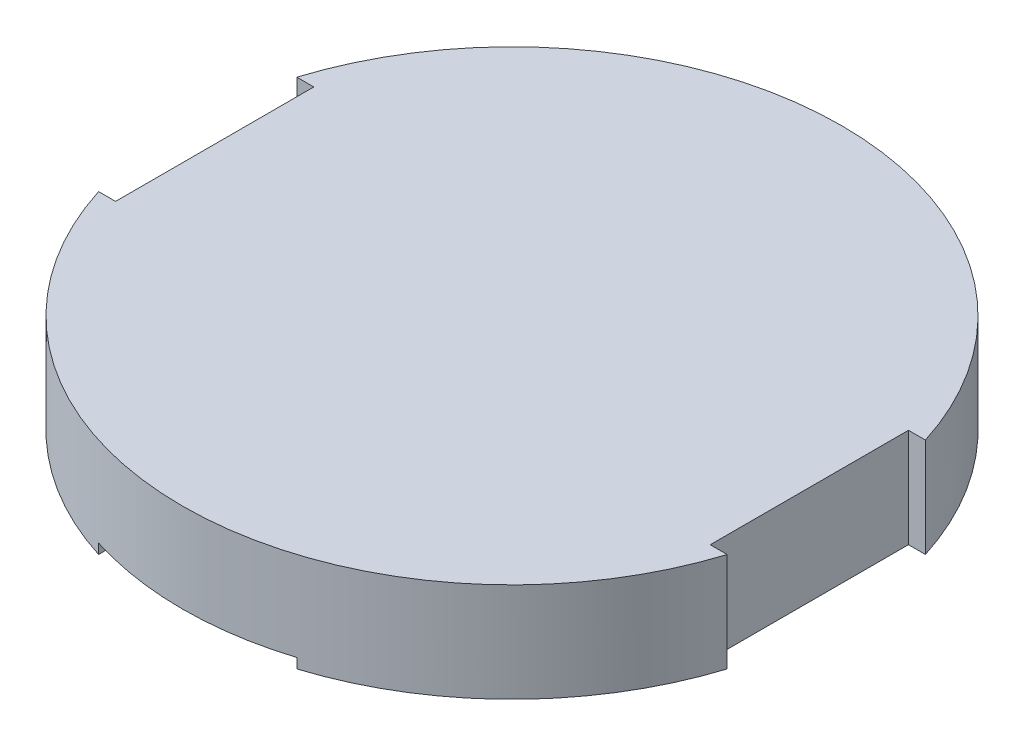
ISO-10303-21;
HEADER;
FILE_DESCRIPTION(('STEP AP214'),'2;1');
FILE_NAME('part.step','',(''),(''),'','','');
FILE_SCHEMA(('AUTOMOTIVE_DESIGN { 1 0 10303 214 1 1 1 1 }'));
ENDSEC;
DATA;
#1=APPLICATION_CONTEXT('core data for automotive mechanical design processes');
#2=APPLICATION_PROTOCOL_DEFINITION('international standard','automotive_design',2000,#1);
#3=PRODUCT_CONTEXT('',#1,'mechanical');
#4=PRODUCT('Part','Part','',(#3));
#5=PRODUCT_RELATED_PRODUCT_CATEGORY('part','',(#4));
#6=PRODUCT_DEFINITION_FORMATION('','',#4);
#7=PRODUCT_DEFINITION_CONTEXT('part definition',#1,'design');
#8=PRODUCT_DEFINITION('design','',#6,#7);
#9=PRODUCT_DEFINITION_SHAPE('','',#8);
#10=(LENGTH_UNIT() NAMED_UNIT(*) SI_UNIT(.MILLI.,.METRE.));
#11=(NAMED_UNIT(*) PLANE_ANGLE_UNIT() SI_UNIT($,.RADIAN.));
#12=(NAMED_UNIT(*) SI_UNIT($,.STERADIAN.) SOLID_ANGLE_UNIT());
#13=UNCERTAINTY_MEASURE_WITH_UNIT(LENGTH_MEASURE(1.E-05),#10,'distance_accuracy_value','');
#14=(GEOMETRIC_REPRESENTATION_CONTEXT(3) GLOBAL_UNCERTAINTY_ASSIGNED_CONTEXT((#13)) GLOBAL_UNIT_ASSIGNED_CONTEXT((#10,
#11,#12)) REPRESENTATION_CONTEXT('',''));
#15=CARTESIAN_POINT('',(0.,0.,0.));
#16=DIRECTION('',(0.,0.,1.));
#17=DIRECTION('',(1.,0.,0.));
#18=AXIS2_PLACEMENT_3D('',#15,#16,#17);
#19=CARTESIAN_POINT('',(0.,0.,0.));
#20=DIRECTION('',(0.,-1.,0.));
#21=DIRECTION('',(0.,0.,-1.));
#22=AXIS2_PLACEMENT_3D('',#19,#20,#21);
#23=PLANE('',#22);
#24=DIRECTION('',(1.,0.,0.));
#25=VECTOR('',#24,1.);
#26=CARTESIAN_POINT('',(-93.295673905485,0.,20.));
#27=LINE('',#26,#25);
#28=CARTESIAN_POINT('',(-63.4212109628947,0.,20.));
#29=VERTEX_POINT('',#28);
#30=CARTESIAN_POINT('',(-60.,0.,20.));
#31=VERTEX_POINT('',#30);
#32=EDGE_CURVE('E121',#29,#31,#27,.T.);
#33=ORIENTED_EDGE('',*,*,#32,.T.);
#34=DIRECTION('',(0.,0.,-1.));
#35=VECTOR('',#34,1.);
#36=CARTESIAN_POINT('',(-60.,0.,20.));
#37=LINE('',#36,#35);
#38=CARTESIAN_POINT('',(-60.,0.,-20.));
#39=VERTEX_POINT('',#38);
#40=EDGE_CURVE('E122',#31,#39,#37,.T.);
#41=ORIENTED_EDGE('',*,*,#40,.T.);
#42=DIRECTION('',(-1.,0.,0.));
#43=VECTOR('',#42,1.);
#44=CARTESIAN_POINT('',(-93.295673905485,0.,-20.));
#45=LINE('',#44,#43);
#46=CARTESIAN_POINT('',(-63.4212109628947,0.,-20.));
#47=VERTEX_POINT('',#46);
#48=EDGE_CURVE('E118',#39,#47,#45,.T.);
#49=ORIENTED_EDGE('',*,*,#48,.T.);
#50=CARTESIAN_POINT('',(0.,0.,0.));
#51=DIRECTION('',(0.,-1.,0.));
#52=DIRECTION('',(0.,0.,-1.));
#53=AXIS2_PLACEMENT_3D('',#50,#51,#52);
#54=CIRCLE('',#53,66.5);
#55=CARTESIAN_POINT('',(-20.,0.,-63.4212109628947));
#56=VERTEX_POINT('',#55);
#57=EDGE_CURVE('E212',#56,#47,#54,.F.);
#58=ORIENTED_EDGE('',*,*,#57,.F.);
#59=DIRECTION('',(0.,0.,1.));
#60=VECTOR('',#59,1.);
#61=CARTESIAN_POINT('',(-20.,0.,-66.5));
#62=LINE('',#61,#60);
#63=CARTESIAN_POINT('',(-20.,0.,63.4212109628948));
#64=VERTEX_POINT('',#63);
#65=EDGE_CURVE('E197',#56,#64,#62,.T.);
#66=ORIENTED_EDGE('',*,*,#65,.T.);
#67=CARTESIAN_POINT('',(0.,0.,0.));
#68=DIRECTION('',(0.,-1.,0.));
#69=DIRECTION('',(0.,0.,-1.));
#70=AXIS2_PLACEMENT_3D('',#67,#68,#69);
#71=CIRCLE('',#70,66.5);
#72=EDGE_CURVE('E160',#29,#64,#71,.F.);
#73=ORIENTED_EDGE('',*,*,#72,.F.);
#74=EDGE_LOOP('',(#33,#41,#49,#58,#66,#73));
#75=FACE_BOUND('',#74,.T.);
#76=ADVANCED_FACE('F18',(#75),#23,.T.);
#77=CARTESIAN_POINT('',(-20.,0.,-66.5));
#78=DIRECTION('',(-1.,0.,0.));
#79=DIRECTION('',(0.,0.,1.));
#80=AXIS2_PLACEMENT_3D('',#77,#78,#79);
#81=PLANE('',#80);
#82=DIRECTION('',(0.,0.,1.));
#83=VECTOR('',#82,1.);
#84=CARTESIAN_POINT('',(-20.,2.,-66.5));
#85=LINE('',#84,#83);
#86=CARTESIAN_POINT('',(-20.,2.,-63.4212109628947));
#87=VERTEX_POINT('',#86);
#88=CARTESIAN_POINT('',(-20.,2.,63.4212109628948));
#89=VERTEX_POINT('',#88);
#90=EDGE_CURVE('E195',#87,#89,#85,.T.);
#91=ORIENTED_EDGE('',*,*,#90,.T.);
#92=DIRECTION('',(0.,-1.,0.));
#93=VECTOR('',#92,1.);
#94=CARTESIAN_POINT('',(-20.,0.,63.4212109628948));
#95=LINE('',#94,#93);
#96=EDGE_CURVE('E198',#64,#89,#95,.F.);
#97=ORIENTED_EDGE('',*,*,#96,.F.);
#98=ORIENTED_EDGE('',*,*,#65,.F.);
#99=DIRECTION('',(0.,-1.,0.));
#100=VECTOR('',#99,1.);
#101=CARTESIAN_POINT('',(-20.,0.,-63.4212109628947));
#102=LINE('',#101,#100);
#103=EDGE_CURVE('E215',#87,#56,#102,.T.);
#104=ORIENTED_EDGE('',*,*,#103,.F.);
#105=EDGE_LOOP('',(#91,#97,#98,#104));
#106=FACE_BOUND('',#105,.T.);
#107=ADVANCED_FACE('F254',(#106),#81,.F.);
#108=CARTESIAN_POINT('',(-20.,2.,-66.5));
#109=DIRECTION('',(0.,1.,0.));
#110=DIRECTION('',(0.,0.,1.));
#111=AXIS2_PLACEMENT_3D('',#108,#109,#110);
#112=PLANE('',#111);
#113=CARTESIAN_POINT('',(0.,2.,0.));
#114=DIRECTION('',(0.,-1.,0.));
#115=DIRECTION('',(0.,0.,-1.));
#116=AXIS2_PLACEMENT_3D('',#113,#114,#115);
#117=CIRCLE('',#116,66.5);
#118=CARTESIAN_POINT('',(20.,2.,-63.4212109628947));
#119=VERTEX_POINT('',#118);
#120=EDGE_CURVE('E218',#119,#87,#117,.F.);
#121=ORIENTED_EDGE('',*,*,#120,.F.);
#122=DIRECTION('',(0.,0.,-1.));
#123=VECTOR('',#122,1.);
#124=CARTESIAN_POINT('',(20.,2.,-66.5));
#125=LINE('',#124,#123);
#126=CARTESIAN_POINT('',(20.,2.,63.4212109628947));
#127=VERTEX_POINT('',#126);
#128=EDGE_CURVE('E189',#119,#127,#125,.F.);
#129=ORIENTED_EDGE('',*,*,#128,.T.);
#130=CARTESIAN_POINT('',(0.,2.,0.));
#131=DIRECTION('',(0.,-1.,0.));
#132=DIRECTION('',(0.,0.,-1.));
#133=AXIS2_PLACEMENT_3D('',#130,#131,#132);
#134=CIRCLE('',#133,66.5);
#135=EDGE_CURVE('E193',#89,#127,#134,.F.);
#136=ORIENTED_EDGE('',*,*,#135,.F.);
#137=ORIENTED_EDGE('',*,*,#90,.F.);
#138=EDGE_LOOP('',(#121,#129,#136,#137));
#139=FACE_BOUND('',#138,.T.);
#140=ADVANCED_FACE('F243',(#139),#112,.F.);
#141=CARTESIAN_POINT('',(20.,0.,-66.5));
#142=DIRECTION('',(1.,0.,0.));
#143=DIRECTION('',(0.,0.,-1.));
#144=AXIS2_PLACEMENT_3D('',#141,#142,#143);
#145=PLANE('',#144);
#146=ORIENTED_EDGE('',*,*,#128,.F.);
#147=DIRECTION('',(0.,-1.,0.));
#148=VECTOR('',#147,1.);
#149=CARTESIAN_POINT('',(20.,0.,-63.4212109628947));
#150=LINE('',#149,#148);
#151=CARTESIAN_POINT('',(20.,0.,-63.4212109628947));
#152=VERTEX_POINT('',#151);
#153=EDGE_CURVE('E219',#152,#119,#150,.F.);
#154=ORIENTED_EDGE('',*,*,#153,.F.);
#155=DIRECTION('',(0.,0.,-1.));
#156=VECTOR('',#155,1.);
#157=CARTESIAN_POINT('',(20.,0.,0.));
#158=LINE('',#157,#156);
#159=CARTESIAN_POINT('',(20.,0.,63.4212109628947));
#160=VERTEX_POINT('',#159);
#161=EDGE_CURVE('E186',#160,#152,#158,.T.);
#162=ORIENTED_EDGE('',*,*,#161,.F.);
#163=DIRECTION('',(0.,-1.,0.));
#164=VECTOR('',#163,1.);
#165=CARTESIAN_POINT('',(20.,0.,63.4212109628947));
#166=LINE('',#165,#164);
#167=EDGE_CURVE('E190',#127,#160,#166,.T.);
#168=ORIENTED_EDGE('',*,*,#167,.F.);
#169=EDGE_LOOP('',(#146,#154,#162,#168));
#170=FACE_BOUND('',#169,.T.);
#171=ADVANCED_FACE('F247',(#170),#145,.F.);
#172=CARTESIAN_POINT('',(0.,0.,0.));
#173=DIRECTION('',(0.,-1.,0.));
#174=DIRECTION('',(0.,0.,-1.));
#175=AXIS2_PLACEMENT_3D('',#172,#173,#174);
#176=PLANE('',#175);
#177=DIRECTION('',(-1.,0.,0.));
#178=VECTOR('',#177,1.);
#179=CARTESIAN_POINT('',(93.295673905485,0.,-20.));
#180=LINE('',#179,#178);
#181=CARTESIAN_POINT('',(63.4212109628947,0.,-20.));
#182=VERTEX_POINT('',#181);
#183=CARTESIAN_POINT('',(60.,0.,-20.));
#184=VERTEX_POINT('',#183);
#185=EDGE_CURVE('E92',#182,#184,#180,.T.);
#186=ORIENTED_EDGE('',*,*,#185,.T.);
#187=DIRECTION('',(0.,0.,1.));
#188=VECTOR('',#187,1.);
#189=CARTESIAN_POINT('',(60.,0.,20.));
#190=LINE('',#189,#188);
#191=CARTESIAN_POINT('',(60.,0.,20.));
#192=VERTEX_POINT('',#191);
#193=EDGE_CURVE('E183',#184,#192,#190,.T.);
#194=ORIENTED_EDGE('',*,*,#193,.T.);
#195=DIRECTION('',(1.,0.,0.));
#196=VECTOR('',#195,1.);
#197=CARTESIAN_POINT('',(93.295673905485,0.,20.));
#198=LINE('',#197,#196);
#199=CARTESIAN_POINT('',(63.4212109628947,0.,20.));
#200=VERTEX_POINT('',#199);
#201=EDGE_CURVE('E188',#192,#200,#198,.T.);
#202=ORIENTED_EDGE('',*,*,#201,.T.);
#203=CARTESIAN_POINT('',(0.,0.,0.));
#204=DIRECTION('',(0.,-1.,0.));
#205=DIRECTION('',(0.,0.,-1.));
#206=AXIS2_PLACEMENT_3D('',#203,#204,#205);
#207=CIRCLE('',#206,66.5);
#208=EDGE_CURVE('E153',#160,#200,#207,.F.);
#209=ORIENTED_EDGE('',*,*,#208,.F.);
#210=ORIENTED_EDGE('',*,*,#161,.T.);
#211=CARTESIAN_POINT('',(0.,0.,0.));
#212=DIRECTION('',(0.,-1.,0.));
#213=DIRECTION('',(0.,0.,-1.));
#214=AXIS2_PLACEMENT_3D('',#211,#212,#213);
#215=CIRCLE('',#214,66.5);
#216=EDGE_CURVE('E21',#182,#152,#215,.F.);
#217=ORIENTED_EDGE('',*,*,#216,.F.);
#218=EDGE_LOOP('',(#186,#194,#202,#209,#210,#217));
#219=FACE_BOUND('',#218,.T.);
#220=ADVANCED_FACE('F264',(#219),#176,.T.);
#221=CARTESIAN_POINT('',(93.295673905485,0.,20.));
#222=DIRECTION('',(0.,0.,1.));
#223=DIRECTION('',(1.,0.,0.));
#224=AXIS2_PLACEMENT_3D('',#221,#222,#223);
#225=PLANE('',#224);
#226=ORIENTED_EDGE('',*,*,#201,.F.);
#227=DIRECTION('',(0.,1.,0.));
#228=VECTOR('',#227,1.);
#229=CARTESIAN_POINT('',(60.,0.,20.));
#230=LINE('',#229,#228);
#231=CARTESIAN_POINT('',(60.,20.,20.));
#232=VERTEX_POINT('',#231);
#233=EDGE_CURVE('E181',#192,#232,#230,.T.);
#234=ORIENTED_EDGE('',*,*,#233,.T.);
#235=DIRECTION('',(1.,0.,0.));
#236=VECTOR('',#235,1.);
#237=CARTESIAN_POINT('',(66.5,20.,20.));
#238=LINE('',#237,#236);
#239=CARTESIAN_POINT('',(63.4212109628947,20.,20.));
#240=VERTEX_POINT('',#239);
#241=EDGE_CURVE('E150',#240,#232,#238,.F.);
#242=ORIENTED_EDGE('',*,*,#241,.F.);
#243=DIRECTION('',(0.,-1.,0.));
#244=VECTOR('',#243,1.);
#245=CARTESIAN_POINT('',(63.4212109628947,0.,20.));
#246=LINE('',#245,#244);
#247=EDGE_CURVE('E156',#200,#240,#246,.F.);
#248=ORIENTED_EDGE('',*,*,#247,.F.);
#249=EDGE_LOOP('',(#226,#234,#242,#248));
#250=FACE_BOUND('',#249,.T.);
#251=ADVANCED_FACE('F267',(#250),#225,.F.);
#252=CARTESIAN_POINT('',(60.,0.,20.));
#253=DIRECTION('',(-1.,0.,0.));
#254=DIRECTION('',(0.,0.,1.));
#255=AXIS2_PLACEMENT_3D('',#252,#253,#254);
#256=PLANE('',#255);
#257=ORIENTED_EDGE('',*,*,#233,.F.);
#258=ORIENTED_EDGE('',*,*,#193,.F.);
#259=DIRECTION('',(0.,1.,0.));
#260=VECTOR('',#259,1.);
#261=CARTESIAN_POINT('',(60.,0.,-20.));
#262=LINE('',#261,#260);
#263=CARTESIAN_POINT('',(60.,20.,-20.));
#264=VERTEX_POINT('',#263);
#265=EDGE_CURVE('E173',#184,#264,#262,.T.);
#266=ORIENTED_EDGE('',*,*,#265,.T.);
#267=DIRECTION('',(0.,0.,1.));
#268=VECTOR('',#267,1.);
#269=CARTESIAN_POINT('',(60.,20.,0.));
#270=LINE('',#269,#268);
#271=EDGE_CURVE('E147',#232,#264,#270,.F.);
#272=ORIENTED_EDGE('',*,*,#271,.F.);
#273=EDGE_LOOP('',(#257,#258,#266,#272));
#274=FACE_BOUND('',#273,.T.);
#275=ADVANCED_FACE('F262',(#274),#256,.F.);
#276=CARTESIAN_POINT('',(93.295673905485,0.,-20.));
#277=DIRECTION('',(0.,0.,-1.));
#278=DIRECTION('',(-1.,0.,0.));
#279=AXIS2_PLACEMENT_3D('',#276,#277,#278);
#280=PLANE('',#279);
#281=DIRECTION('',(1.,0.,0.));
#282=VECTOR('',#281,1.);
#283=CARTESIAN_POINT('',(66.5,20.,-20.));
#284=LINE('',#283,#282);
#285=CARTESIAN_POINT('',(63.4212109628947,20.,-20.));
#286=VERTEX_POINT('',#285);
#287=EDGE_CURVE('E138',#264,#286,#284,.T.);
#288=ORIENTED_EDGE('',*,*,#287,.F.);
#289=ORIENTED_EDGE('',*,*,#265,.F.);
#290=ORIENTED_EDGE('',*,*,#185,.F.);
#291=DIRECTION('',(0.,-1.,0.));
#292=VECTOR('',#291,1.);
#293=CARTESIAN_POINT('',(63.4212109628947,0.,-20.));
#294=LINE('',#293,#292);
#295=EDGE_CURVE('E170',#286,#182,#294,.T.);
#296=ORIENTED_EDGE('',*,*,#295,.F.);
#297=EDGE_LOOP('',(#288,#289,#290,#296));
#298=FACE_BOUND('',#297,.T.);
#299=ADVANCED_FACE('F259',(#298),#280,.F.);
#300=CARTESIAN_POINT('',(0.,0.,0.));
#301=DIRECTION('',(0.,-1.,0.));
#302=DIRECTION('',(0.,0.,-1.));
#303=AXIS2_PLACEMENT_3D('',#300,#301,#302);
#304=CYLINDRICAL_SURFACE('',#303,66.5);
#305=ORIENTED_EDGE('',*,*,#57,.T.);
#306=DIRECTION('',(0.,1.,0.));
#307=VECTOR('',#306,1.);
#308=CARTESIAN_POINT('',(-63.4212109628947,0.,-20.));
#309=LINE('',#308,#307);
#310=CARTESIAN_POINT('',(-63.4212109628947,20.,-20.));
#311=VERTEX_POINT('',#310);
#312=EDGE_CURVE('E168',#47,#311,#309,.T.);
#313=ORIENTED_EDGE('',*,*,#312,.T.);
#314=CARTESIAN_POINT('',(0.,20.,0.));
#315=DIRECTION('',(0.,-1.,0.));
#316=DIRECTION('',(0.,0.,-1.));
#317=AXIS2_PLACEMENT_3D('',#314,#315,#316);
#318=CIRCLE('',#317,66.5);
#319=EDGE_CURVE('E135',#286,#311,#318,.F.);
#320=ORIENTED_EDGE('',*,*,#319,.F.);
#321=ORIENTED_EDGE('',*,*,#295,.T.);
#322=ORIENTED_EDGE('',*,*,#216,.T.);
#323=ORIENTED_EDGE('',*,*,#153,.T.);
#324=ORIENTED_EDGE('',*,*,#120,.T.);
#325=ORIENTED_EDGE('',*,*,#103,.T.);
#326=EDGE_LOOP('',(#305,#313,#320,#321,#322,#323,#324,#325));
#327=FACE_BOUND('',#326,.T.);
#328=ADVANCED_FACE('F237',(#327),#304,.T.);
#329=CARTESIAN_POINT('',(-93.295673905485,0.,-20.));
#330=DIRECTION('',(0.,0.,-1.));
#331=DIRECTION('',(-1.,0.,0.));
#332=AXIS2_PLACEMENT_3D('',#329,#330,#331);
#333=PLANE('',#332);
#334=ORIENTED_EDGE('',*,*,#48,.F.);
#335=DIRECTION('',(0.,1.,0.));
#336=VECTOR('',#335,1.);
#337=CARTESIAN_POINT('',(-60.,0.,-20.));
#338=LINE('',#337,#336);
#339=CARTESIAN_POINT('',(-60.,20.,-20.));
#340=VERTEX_POINT('',#339);
#341=EDGE_CURVE('E112',#39,#340,#338,.T.);
#342=ORIENTED_EDGE('',*,*,#341,.T.);
#343=DIRECTION('',(1.,0.,0.));
#344=VECTOR('',#343,1.);
#345=CARTESIAN_POINT('',(66.5,20.,-20.));
#346=LINE('',#345,#344);
#347=EDGE_CURVE('E117',#311,#340,#346,.T.);
#348=ORIENTED_EDGE('',*,*,#347,.F.);
#349=ORIENTED_EDGE('',*,*,#312,.F.);
#350=EDGE_LOOP('',(#334,#342,#348,#349));
#351=FACE_BOUND('',#350,.T.);
#352=ADVANCED_FACE('F114',(#351),#333,.F.);
#353=CARTESIAN_POINT('',(-60.,0.,20.));
#354=DIRECTION('',(1.,0.,0.));
#355=DIRECTION('',(0.,0.,-1.));
#356=AXIS2_PLACEMENT_3D('',#353,#354,#355);
#357=PLANE('',#356);
#358=ORIENTED_EDGE('',*,*,#341,.F.);
#359=ORIENTED_EDGE('',*,*,#40,.F.);
#360=DIRECTION('',(0.,1.,0.));
#361=VECTOR('',#360,1.);
#362=CARTESIAN_POINT('',(-60.,0.,20.));
#363=LINE('',#362,#361);
#364=CARTESIAN_POINT('',(-60.,20.,20.));
#365=VERTEX_POINT('',#364);
#366=EDGE_CURVE('E128',#31,#365,#363,.T.);
#367=ORIENTED_EDGE('',*,*,#366,.T.);
#368=DIRECTION('',(0.,0.,1.));
#369=VECTOR('',#368,1.);
#370=CARTESIAN_POINT('',(-60.,20.,0.));
#371=LINE('',#370,#369);
#372=EDGE_CURVE('E125',#340,#365,#371,.T.);
#373=ORIENTED_EDGE('',*,*,#372,.F.);
#374=EDGE_LOOP('',(#358,#359,#367,#373));
#375=FACE_BOUND('',#374,.T.);
#376=ADVANCED_FACE('F126',(#375),#357,.F.);
#377=CARTESIAN_POINT('',(-93.295673905485,0.,20.));
#378=DIRECTION('',(0.,0.,1.));
#379=DIRECTION('',(1.,0.,0.));
#380=AXIS2_PLACEMENT_3D('',#377,#378,#379);
#381=PLANE('',#380);
#382=DIRECTION('',(1.,0.,0.));
#383=VECTOR('',#382,1.);
#384=CARTESIAN_POINT('',(66.5,20.,20.));
#385=LINE('',#384,#383);
#386=CARTESIAN_POINT('',(-63.4212109628947,20.,20.));
#387=VERTEX_POINT('',#386);
#388=EDGE_CURVE('E27',#365,#387,#385,.F.);
#389=ORIENTED_EDGE('',*,*,#388,.F.);
#390=ORIENTED_EDGE('',*,*,#366,.F.);
#391=ORIENTED_EDGE('',*,*,#32,.F.);
#392=DIRECTION('',(0.,-1.,0.));
#393=VECTOR('',#392,1.);
#394=CARTESIAN_POINT('',(-63.4212109628947,0.,20.));
#395=LINE('',#394,#393);
#396=EDGE_CURVE('E36',#387,#29,#395,.T.);
#397=ORIENTED_EDGE('',*,*,#396,.F.);
#398=EDGE_LOOP('',(#389,#390,#391,#397));
#399=FACE_BOUND('',#398,.T.);
#400=ADVANCED_FACE('F268',(#399),#381,.F.);
#401=CARTESIAN_POINT('',(0.,0.,0.));
#402=DIRECTION('',(0.,-1.,0.));
#403=DIRECTION('',(0.,0.,-1.));
#404=AXIS2_PLACEMENT_3D('',#401,#402,#403);
#405=CYLINDRICAL_SURFACE('',#404,66.5);
#406=ORIENTED_EDGE('',*,*,#167,.T.);
#407=ORIENTED_EDGE('',*,*,#208,.T.);
#408=ORIENTED_EDGE('',*,*,#247,.T.);
#409=CARTESIAN_POINT('',(0.,20.,0.));
#410=DIRECTION('',(0.,-1.,0.));
#411=DIRECTION('',(0.,0.,-1.));
#412=AXIS2_PLACEMENT_3D('',#409,#410,#411);
#413=CIRCLE('',#412,66.5);
#414=EDGE_CURVE('E11',#387,#240,#413,.F.);
#415=ORIENTED_EDGE('',*,*,#414,.F.);
#416=ORIENTED_EDGE('',*,*,#396,.T.);
#417=ORIENTED_EDGE('',*,*,#72,.T.);
#418=ORIENTED_EDGE('',*,*,#96,.T.);
#419=ORIENTED_EDGE('',*,*,#135,.T.);
#420=EDGE_LOOP('',(#406,#407,#408,#415,#416,#417,#418,#419));
#421=FACE_BOUND('',#420,.T.);
#422=ADVANCED_FACE('F250',(#421),#405,.T.);
#423=CARTESIAN_POINT('',(66.5,20.,0.));
#424=DIRECTION('',(0.,1.,0.));
#425=DIRECTION('',(0.,0.,1.));
#426=AXIS2_PLACEMENT_3D('',#423,#424,#425);
#427=PLANE('',#426);
#428=ORIENTED_EDGE('',*,*,#388,.T.);
#429=ORIENTED_EDGE('',*,*,#414,.T.);
#430=ORIENTED_EDGE('',*,*,#241,.T.);
#431=ORIENTED_EDGE('',*,*,#271,.T.);
#432=ORIENTED_EDGE('',*,*,#287,.T.);
#433=ORIENTED_EDGE('',*,*,#319,.T.);
#434=ORIENTED_EDGE('',*,*,#347,.T.);
#435=ORIENTED_EDGE('',*,*,#372,.T.);
#436=EDGE_LOOP('',(#428,#429,#430,#431,#432,#433,#434,#435));
#437=FACE_BOUND('',#436,.T.);
#438=ADVANCED_FACE('F132',(#437),#427,.T.);
#439=CLOSED_SHELL('',(#76,#107,#140,#171,#220,#251,#275,#299,#328,#352,#376,#400,#422,#438));
#440=MANIFOLD_SOLID_BREP('B1',#439);
#441=ADVANCED_BREP_SHAPE_REPRESENTATION('',(#18,#440),#14);
#442=SHAPE_DEFINITION_REPRESENTATION(#9,#441);
ENDSEC;
END-ISO-10303-21;
